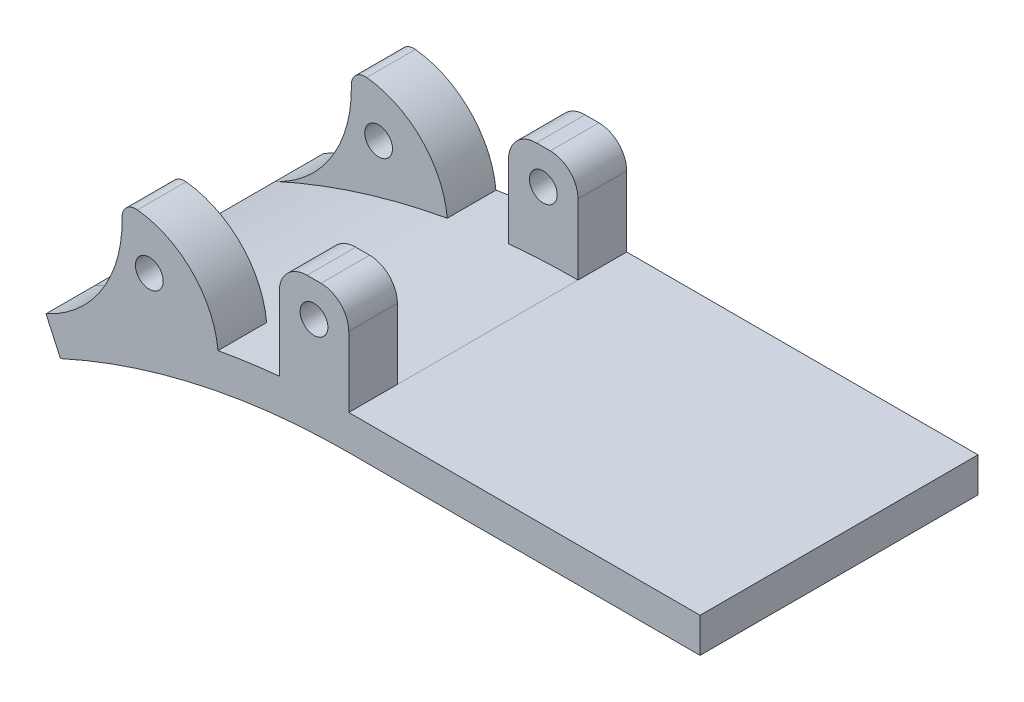
ISO-10303-21;
HEADER;
FILE_DESCRIPTION(('STEP AP214'),'2;1');
FILE_NAME('part.step','',(''),(''),'','','');
FILE_SCHEMA(('AUTOMOTIVE_DESIGN { 1 0 10303 214 1 1 1 1 }'));
ENDSEC;
DATA;
#1=APPLICATION_CONTEXT('core data for automotive mechanical design processes');
#2=APPLICATION_PROTOCOL_DEFINITION('international standard','automotive_design',2000,#1);
#3=PRODUCT_CONTEXT('',#1,'mechanical');
#4=PRODUCT('Part','Part','',(#3));
#5=PRODUCT_RELATED_PRODUCT_CATEGORY('part','',(#4));
#6=PRODUCT_DEFINITION_FORMATION('','',#4);
#7=PRODUCT_DEFINITION_CONTEXT('part definition',#1,'design');
#8=PRODUCT_DEFINITION('design','',#6,#7);
#9=PRODUCT_DEFINITION_SHAPE('','',#8);
#10=(LENGTH_UNIT() NAMED_UNIT(*) SI_UNIT(.MILLI.,.METRE.));
#11=(NAMED_UNIT(*) PLANE_ANGLE_UNIT() SI_UNIT($,.RADIAN.));
#12=(NAMED_UNIT(*) SI_UNIT($,.STERADIAN.) SOLID_ANGLE_UNIT());
#13=UNCERTAINTY_MEASURE_WITH_UNIT(LENGTH_MEASURE(1.E-05),#10,'distance_accuracy_value','');
#14=(GEOMETRIC_REPRESENTATION_CONTEXT(3) GLOBAL_UNCERTAINTY_ASSIGNED_CONTEXT((#13)) GLOBAL_UNIT_ASSIGNED_CONTEXT((#10,
#11,#12)) REPRESENTATION_CONTEXT('',''));
#15=CARTESIAN_POINT('',(0.,0.,0.));
#16=DIRECTION('',(0.,0.,1.));
#17=DIRECTION('',(1.,0.,0.));
#18=AXIS2_PLACEMENT_3D('',#15,#16,#17);
#19=CARTESIAN_POINT('',(42.6716125413464,-120.300375652099,-1.));
#20=DIRECTION('',(0.,0.,-1.));
#21=DIRECTION('',(-1.,0.,0.));
#22=AXIS2_PLACEMENT_3D('',#19,#20,#21);
#23=PLANE('',#22);
#24=CARTESIAN_POINT('',(42.6716125413464,-120.300375652099,-1.));
#25=DIRECTION('',(0.,0.,1.));
#26=DIRECTION('',(1.,0.,0.));
#27=AXIS2_PLACEMENT_3D('',#24,#25,#26);
#28=CIRCLE('',#27,99.8209717605931);
#29=CARTESIAN_POINT('',(42.671612541347,-20.4794038915055,-1.));
#30=VERTEX_POINT('',#29);
#31=CARTESIAN_POINT('',(1.1775006641315,-29.5123528586139,-1.));
#32=VERTEX_POINT('',#31);
#33=EDGE_CURVE('E388',#30,#32,#28,.T.);
#34=ORIENTED_EDGE('',*,*,#33,.T.);
#35=DIRECTION('',(0.415685312869252,-0.909508504998602,0.));
#36=VECTOR('',#35,1.);
#37=CARTESIAN_POINT('',(-0.900925900214761,-24.9648103336209,-1.));
#38=LINE('',#37,#36);
#39=CARTESIAN_POINT('',(-0.900925900214768,-24.9648103336209,-1.));
#40=VERTEX_POINT('',#39);
#41=EDGE_CURVE('E407',#40,#32,#38,.T.);
#42=ORIENTED_EDGE('',*,*,#41,.F.);
#43=CARTESIAN_POINT('',(-8.69243048840007,-7.91720371799062,-1.));
#44=DIRECTION('',(0.,0.,1.));
#45=DIRECTION('',(1.,0.,0.));
#46=AXIS2_PLACEMENT_3D('',#43,#44,#45);
#47=CIRCLE('',#46,18.7437572292482);
#48=CARTESIAN_POINT('',(10.0460894672162,-7.47414058257501,-1.));
#49=VERTEX_POINT('',#48);
#50=EDGE_CURVE('E358',#40,#49,#47,.T.);
#51=ORIENTED_EDGE('',*,*,#50,.T.);
#52=CARTESIAN_POINT('',(12.0455306386347,-7.42686477442228,-1.));
#53=DIRECTION('',(0.,0.,-1.));
#54=DIRECTION('',(-1.,0.,0.));
#55=AXIS2_PLACEMENT_3D('',#52,#53,#54);
#56=CIRCLE('',#55,2.);
#57=CARTESIAN_POINT('',(12.254952675335,-5.43785939219117,-1.));
#58=VERTEX_POINT('',#57);
#59=EDGE_CURVE('E375',#49,#58,#56,.T.);
#60=ORIENTED_EDGE('',*,*,#59,.T.);
#61=CARTESIAN_POINT('',(10.892712538025,-18.3758625158982,-1.));
#62=DIRECTION('',(0.,0.,-1.));
#63=DIRECTION('',(1.,0.,0.));
#64=AXIS2_PLACEMENT_3D('',#61,#62,#63);
#65=CIRCLE('',#64,13.0095204762033);
#66=CARTESIAN_POINT('',(23.8474768306708,-17.1835097397702,-1.));
#67=VERTEX_POINT('',#66);
#68=EDGE_CURVE('E365',#58,#67,#65,.T.);
#69=ORIENTED_EDGE('',*,*,#68,.T.);
#70=CARTESIAN_POINT('',(42.6716125413464,-120.300375652099,-1.));
#71=DIRECTION('',(0.,0.,1.));
#72=DIRECTION('',(1.,0.,0.));
#73=AXIS2_PLACEMENT_3D('',#70,#71,#72);
#74=CIRCLE('',#73,104.820971760593);
#75=CARTESIAN_POINT('',(32.671612541347,-15.957497980285,-1.));
#76=VERTEX_POINT('',#75);
#77=EDGE_CURVE('E405',#76,#67,#74,.T.);
#78=ORIENTED_EDGE('',*,*,#77,.F.);
#79=DIRECTION('',(0.,1.,0.));
#80=VECTOR('',#79,1.);
#81=CARTESIAN_POINT('',(32.671612541347,-15.957497980285,-1.));
#82=LINE('',#81,#80);
#83=CARTESIAN_POINT('',(32.671612541347,-5.37678304765752,-1.));
#84=VERTEX_POINT('',#83);
#85=EDGE_CURVE('E215',#76,#84,#82,.T.);
#86=ORIENTED_EDGE('',*,*,#85,.T.);
#87=CARTESIAN_POINT('',(36.671612541347,-5.37678304765752,-1.));
#88=DIRECTION('',(0.,0.,-1.));
#89=DIRECTION('',(-1.,0.,0.));
#90=AXIS2_PLACEMENT_3D('',#87,#88,#89);
#91=CIRCLE('',#90,4.);
#92=CARTESIAN_POINT('',(36.671612541347,-1.37678304765752,-1.));
#93=VERTEX_POINT('',#92);
#94=EDGE_CURVE('E251',#84,#93,#91,.T.);
#95=ORIENTED_EDGE('',*,*,#94,.T.);
#96=DIRECTION('',(1.,0.,0.));
#97=VECTOR('',#96,1.);
#98=CARTESIAN_POINT('',(36.671612541347,-1.37678304765752,-1.));
#99=LINE('',#98,#97);
#100=CARTESIAN_POINT('',(38.671612541347,-1.37678304765752,-1.));
#101=VERTEX_POINT('',#100);
#102=EDGE_CURVE('E255',#93,#101,#99,.T.);
#103=ORIENTED_EDGE('',*,*,#102,.T.);
#104=CARTESIAN_POINT('',(38.671612541347,-5.37678304765752,-1.));
#105=DIRECTION('',(0.,0.,-1.));
#106=DIRECTION('',(-1.,0.,0.));
#107=AXIS2_PLACEMENT_3D('',#104,#105,#106);
#108=CIRCLE('',#107,4.);
#109=CARTESIAN_POINT('',(42.671612541347,-5.37678304765755,-1.));
#110=VERTEX_POINT('',#109);
#111=EDGE_CURVE('E236',#101,#110,#108,.T.);
#112=ORIENTED_EDGE('',*,*,#111,.T.);
#113=DIRECTION('',(0.,-1.,0.));
#114=VECTOR('',#113,1.);
#115=CARTESIAN_POINT('',(42.671612541347,-5.37678304765755,-1.));
#116=LINE('',#115,#114);
#117=CARTESIAN_POINT('',(42.6716125413471,-15.4794038915055,-1.));
#118=VERTEX_POINT('',#117);
#119=EDGE_CURVE('E233',#110,#118,#116,.T.);
#120=ORIENTED_EDGE('',*,*,#119,.T.);
#121=DIRECTION('',(-1.,0.,0.));
#122=VECTOR('',#121,1.);
#123=CARTESIAN_POINT('',(42.671612541347,-15.4794038915055,-1.));
#124=LINE('',#123,#122);
#125=CARTESIAN_POINT('',(93.2317342644276,-15.4794038915057,-1.));
#126=VERTEX_POINT('',#125);
#127=EDGE_CURVE('E401',#126,#118,#124,.T.);
#128=ORIENTED_EDGE('',*,*,#127,.F.);
#129=DIRECTION('',(0.,1.,0.));
#130=VECTOR('',#129,1.);
#131=CARTESIAN_POINT('',(93.2317342644276,-15.4794038915057,-1.));
#132=LINE('',#131,#130);
#133=CARTESIAN_POINT('',(93.2317342644276,-20.4794038915057,-1.));
#134=VERTEX_POINT('',#133);
#135=EDGE_CURVE('E398',#134,#126,#132,.T.);
#136=ORIENTED_EDGE('',*,*,#135,.F.);
#137=DIRECTION('',(-1.,0.,0.));
#138=VECTOR('',#137,1.);
#139=CARTESIAN_POINT('',(93.2317342644276,-20.4794038915057,-1.));
#140=LINE('',#139,#138);
#141=EDGE_CURVE('E385',#134,#30,#140,.T.);
#142=ORIENTED_EDGE('',*,*,#141,.T.);
#143=EDGE_LOOP('',(#34,#42,#51,#60,#69,#78,#86,#95,#103,#112,#120,#128,#136,#142));
#144=FACE_BOUND('',#143,.T.);
#145=CARTESIAN_POINT('',(13.9662746895762,-12.4794038915054,-1.));
#146=DIRECTION('',(0.,0.,-1.));
#147=DIRECTION('',(-1.,0.,0.));
#148=AXIS2_PLACEMENT_3D('',#145,#146,#147);
#149=CIRCLE('',#148,2.);
#150=CARTESIAN_POINT('',(11.9662746895762,-12.4794038915054,-1.));
#151=VERTEX_POINT('',#150);
#152=EDGE_CURVE('E348',#151,#151,#149,.T.);
#153=ORIENTED_EDGE('',*,*,#152,.F.);
#154=EDGE_LOOP('',(#153));
#155=FACE_BOUND('',#154,.T.);
#156=CARTESIAN_POINT('',(37.671612541347,-6.37678304765752,-1.));
#157=DIRECTION('',(0.,0.,-1.));
#158=DIRECTION('',(-1.,0.,0.));
#159=AXIS2_PLACEMENT_3D('',#156,#157,#158);
#160=CIRCLE('',#159,2.);
#161=CARTESIAN_POINT('',(35.671612541347,-6.37678304765752,-1.));
#162=VERTEX_POINT('',#161);
#163=EDGE_CURVE('E239',#162,#162,#160,.T.);
#164=ORIENTED_EDGE('',*,*,#163,.F.);
#165=EDGE_LOOP('',(#164));
#166=FACE_BOUND('',#165,.T.);
#167=ADVANCED_FACE('F51',(#144,#155,#166),#23,.T.);
#168=CARTESIAN_POINT('',(42.6716125413464,-120.300375652099,39.));
#169=DIRECTION('',(0.,0.,1.));
#170=DIRECTION('',(-1.,0.,0.));
#171=AXIS2_PLACEMENT_3D('',#168,#169,#170);
#172=PLANE('',#171);
#173=CARTESIAN_POINT('',(42.6716125413464,-120.300375652099,39.));
#174=DIRECTION('',(0.,0.,1.));
#175=DIRECTION('',(1.,0.,0.));
#176=AXIS2_PLACEMENT_3D('',#173,#174,#175);
#177=CIRCLE('',#176,99.8209717605931);
#178=CARTESIAN_POINT('',(42.671612541347,-20.4794038915055,39.));
#179=VERTEX_POINT('',#178);
#180=CARTESIAN_POINT('',(1.1775006641315,-29.5123528586139,39.));
#181=VERTEX_POINT('',#180);
#182=EDGE_CURVE('E389',#179,#181,#177,.T.);
#183=ORIENTED_EDGE('',*,*,#182,.F.);
#184=DIRECTION('',(-1.,0.,0.));
#185=VECTOR('',#184,1.);
#186=CARTESIAN_POINT('',(93.2317342644276,-20.4794038915057,39.));
#187=LINE('',#186,#185);
#188=CARTESIAN_POINT('',(93.2317342644276,-20.4794038915057,39.));
#189=VERTEX_POINT('',#188);
#190=EDGE_CURVE('E381',#189,#179,#187,.T.);
#191=ORIENTED_EDGE('',*,*,#190,.F.);
#192=DIRECTION('',(0.,1.,0.));
#193=VECTOR('',#192,1.);
#194=CARTESIAN_POINT('',(93.2317342644276,-15.4794038915057,39.));
#195=LINE('',#194,#193);
#196=CARTESIAN_POINT('',(93.2317342644276,-15.4794038915057,39.));
#197=VERTEX_POINT('',#196);
#198=EDGE_CURVE('E397',#189,#197,#195,.T.);
#199=ORIENTED_EDGE('',*,*,#198,.T.);
#200=DIRECTION('',(-1.,0.,0.));
#201=VECTOR('',#200,1.);
#202=CARTESIAN_POINT('',(42.671612541347,-15.4794038915055,39.));
#203=LINE('',#202,#201);
#204=CARTESIAN_POINT('',(42.671612541347,-15.4794038915055,39.));
#205=VERTEX_POINT('',#204);
#206=EDGE_CURVE('E413',#197,#205,#203,.T.);
#207=ORIENTED_EDGE('',*,*,#206,.T.);
#208=DIRECTION('',(0.,1.,0.));
#209=VECTOR('',#208,1.);
#210=CARTESIAN_POINT('',(42.671612541347,-15.4794038915055,39.));
#211=LINE('',#210,#209);
#212=CARTESIAN_POINT('',(42.671612541347,-5.37678304765755,39.));
#213=VERTEX_POINT('',#212);
#214=EDGE_CURVE('E271',#205,#213,#211,.T.);
#215=ORIENTED_EDGE('',*,*,#214,.T.);
#216=CARTESIAN_POINT('',(38.671612541347,-5.37678304765752,39.));
#217=DIRECTION('',(0.,0.,1.));
#218=DIRECTION('',(1.,0.,0.));
#219=AXIS2_PLACEMENT_3D('',#216,#217,#218);
#220=CIRCLE('',#219,4.);
#221=CARTESIAN_POINT('',(38.671612541347,-1.37678304765752,39.));
#222=VERTEX_POINT('',#221);
#223=EDGE_CURVE('E295',#213,#222,#220,.T.);
#224=ORIENTED_EDGE('',*,*,#223,.T.);
#225=DIRECTION('',(-1.,0.,0.));
#226=VECTOR('',#225,1.);
#227=CARTESIAN_POINT('',(38.671612541347,-1.37678304765752,39.));
#228=LINE('',#227,#226);
#229=CARTESIAN_POINT('',(36.671612541347,-1.37678304765752,39.));
#230=VERTEX_POINT('',#229);
#231=EDGE_CURVE('E298',#222,#230,#228,.T.);
#232=ORIENTED_EDGE('',*,*,#231,.T.);
#233=CARTESIAN_POINT('',(36.671612541347,-5.37678304765752,39.));
#234=DIRECTION('',(0.,0.,1.));
#235=DIRECTION('',(1.,0.,0.));
#236=AXIS2_PLACEMENT_3D('',#233,#234,#235);
#237=CIRCLE('',#236,4.);
#238=CARTESIAN_POINT('',(32.671612541347,-5.37678304765752,39.));
#239=VERTEX_POINT('',#238);
#240=EDGE_CURVE('E301',#230,#239,#237,.T.);
#241=ORIENTED_EDGE('',*,*,#240,.T.);
#242=DIRECTION('',(0.,-1.,0.));
#243=VECTOR('',#242,1.);
#244=CARTESIAN_POINT('',(32.671612541347,-15.957497980285,39.));
#245=LINE('',#244,#243);
#246=CARTESIAN_POINT('',(32.671612541347,-15.957497980285,39.));
#247=VERTEX_POINT('',#246);
#248=EDGE_CURVE('E277',#239,#247,#245,.T.);
#249=ORIENTED_EDGE('',*,*,#248,.T.);
#250=CARTESIAN_POINT('',(42.6716125413464,-120.300375652099,39.));
#251=DIRECTION('',(0.,0.,1.));
#252=DIRECTION('',(1.,0.,0.));
#253=AXIS2_PLACEMENT_3D('',#250,#251,#252);
#254=CIRCLE('',#253,104.820971760593);
#255=CARTESIAN_POINT('',(23.8474768306708,-17.1835097397702,39.));
#256=VERTEX_POINT('',#255);
#257=EDGE_CURVE('E416',#247,#256,#254,.T.);
#258=ORIENTED_EDGE('',*,*,#257,.T.);
#259=CARTESIAN_POINT('',(10.892712538025,-18.3758625158982,39.));
#260=DIRECTION('',(0.,0.,1.));
#261=DIRECTION('',(1.,0.,0.));
#262=AXIS2_PLACEMENT_3D('',#259,#260,#261);
#263=CIRCLE('',#262,13.0095204762033);
#264=CARTESIAN_POINT('',(12.254952675335,-5.43785939219117,39.));
#265=VERTEX_POINT('',#264);
#266=EDGE_CURVE('E322',#256,#265,#263,.T.);
#267=ORIENTED_EDGE('',*,*,#266,.T.);
#268=CARTESIAN_POINT('',(12.0455306386347,-7.42686477442228,39.));
#269=DIRECTION('',(0.,0.,1.));
#270=DIRECTION('',(1.,0.,0.));
#271=AXIS2_PLACEMENT_3D('',#268,#269,#270);
#272=CIRCLE('',#271,2.);
#273=CARTESIAN_POINT('',(10.0460894672162,-7.47414058257501,39.));
#274=VERTEX_POINT('',#273);
#275=EDGE_CURVE('E341',#265,#274,#272,.T.);
#276=ORIENTED_EDGE('',*,*,#275,.T.);
#277=CARTESIAN_POINT('',(-8.69243048840007,-7.91720371799062,39.));
#278=DIRECTION('',(0.,0.,-1.));
#279=DIRECTION('',(1.,0.,0.));
#280=AXIS2_PLACEMENT_3D('',#277,#278,#279);
#281=CIRCLE('',#280,18.7437572292482);
#282=CARTESIAN_POINT('',(-0.900925900214761,-24.9648103336209,39.));
#283=VERTEX_POINT('',#282);
#284=EDGE_CURVE('E329',#274,#283,#281,.T.);
#285=ORIENTED_EDGE('',*,*,#284,.T.);
#286=DIRECTION('',(0.415685312869252,-0.909508504998602,0.));
#287=VECTOR('',#286,1.);
#288=CARTESIAN_POINT('',(-0.900925900214761,-24.9648103336209,39.));
#289=LINE('',#288,#287);
#290=EDGE_CURVE('E402',#283,#181,#289,.T.);
#291=ORIENTED_EDGE('',*,*,#290,.T.);
#292=EDGE_LOOP('',(#183,#191,#199,#207,#215,#224,#232,#241,#249,#258,#267,#276,#285,#291));
#293=FACE_BOUND('',#292,.T.);
#294=CARTESIAN_POINT('',(13.9662746895762,-12.4794038915054,39.));
#295=DIRECTION('',(0.,0.,1.));
#296=DIRECTION('',(1.,0.,0.));
#297=AXIS2_PLACEMENT_3D('',#294,#295,#296);
#298=CIRCLE('',#297,2.);
#299=CARTESIAN_POINT('',(15.9662746895762,-12.4794038915054,39.));
#300=VERTEX_POINT('',#299);
#301=EDGE_CURVE('E308',#300,#300,#298,.T.);
#302=ORIENTED_EDGE('',*,*,#301,.F.);
#303=EDGE_LOOP('',(#302));
#304=FACE_BOUND('',#303,.T.);
#305=CARTESIAN_POINT('',(37.671612541347,-6.37678304765752,39.));
#306=DIRECTION('',(0.,0.,1.));
#307=DIRECTION('',(1.,0.,0.));
#308=AXIS2_PLACEMENT_3D('',#305,#306,#307);
#309=CIRCLE('',#308,2.);
#310=CARTESIAN_POINT('',(39.671612541347,-6.37678304765752,39.));
#311=VERTEX_POINT('',#310);
#312=EDGE_CURVE('E262',#311,#311,#309,.T.);
#313=ORIENTED_EDGE('',*,*,#312,.F.);
#314=EDGE_LOOP('',(#313));
#315=FACE_BOUND('',#314,.T.);
#316=ADVANCED_FACE('F467',(#293,#304,#315),#172,.T.);
#317=CARTESIAN_POINT('',(42.671612541347,-20.4794038915055,-1.));
#318=DIRECTION('',(0.,-1.,0.));
#319=DIRECTION('',(1.,0.,0.));
#320=AXIS2_PLACEMENT_3D('',#317,#318,#319);
#321=PLANE('',#320);
#322=ORIENTED_EDGE('',*,*,#141,.F.);
#323=DIRECTION('',(0.,0.,1.));
#324=VECTOR('',#323,1.);
#325=CARTESIAN_POINT('',(93.2317342644276,-20.4794038915054,-1.));
#326=LINE('',#325,#324);
#327=EDGE_CURVE('E13',#189,#134,#326,.F.);
#328=ORIENTED_EDGE('',*,*,#327,.F.);
#329=ORIENTED_EDGE('',*,*,#190,.T.);
#330=DIRECTION('',(0.,0.,1.));
#331=VECTOR('',#330,1.);
#332=CARTESIAN_POINT('',(42.671612541347,-20.4794038915055,-1.));
#333=LINE('',#332,#331);
#334=EDGE_CURVE('E392',#30,#179,#333,.T.);
#335=ORIENTED_EDGE('',*,*,#334,.F.);
#336=EDGE_LOOP('',(#322,#328,#329,#335));
#337=FACE_BOUND('',#336,.T.);
#338=ADVANCED_FACE('F492',(#337),#321,.T.);
#339=CARTESIAN_POINT('',(-0.900925900214761,-24.9648103336209,-1.));
#340=DIRECTION('',(-0.909508504998602,-0.415685312869252,0.));
#341=DIRECTION('',(0.415685312869252,-0.909508504998602,0.));
#342=AXIS2_PLACEMENT_3D('',#339,#340,#341);
#343=PLANE('',#342);
#344=ORIENTED_EDGE('',*,*,#290,.F.);
#345=DIRECTION('',(0.,0.,1.));
#346=VECTOR('',#345,1.);
#347=CARTESIAN_POINT('',(-0.90092590021477,-24.9648103336209,32.));
#348=LINE('',#347,#346);
#349=CARTESIAN_POINT('',(-0.90092590021477,-24.9648103336209,32.));
#350=VERTEX_POINT('',#349);
#351=EDGE_CURVE('E345',#350,#283,#348,.T.);
#352=ORIENTED_EDGE('',*,*,#351,.F.);
#353=DIRECTION('',(0.,0.,1.));
#354=VECTOR('',#353,1.);
#355=CARTESIAN_POINT('',(-0.900925900214761,-24.9648103336209,-1.));
#356=LINE('',#355,#354);
#357=CARTESIAN_POINT('',(-0.900925900214761,-24.9648103336209,6.));
#358=VERTEX_POINT('',#357);
#359=EDGE_CURVE('E423',#358,#350,#356,.T.);
#360=ORIENTED_EDGE('',*,*,#359,.F.);
#361=EDGE_CURVE('E420',#40,#358,#356,.T.);
#362=ORIENTED_EDGE('',*,*,#361,.F.);
#363=ORIENTED_EDGE('',*,*,#41,.T.);
#364=DIRECTION('',(0.,0.,-1.));
#365=VECTOR('',#364,1.);
#366=CARTESIAN_POINT('',(1.1775006641315,-29.5123528586139,38.));
#367=LINE('',#366,#365);
#368=EDGE_CURVE('E58',#181,#32,#367,.T.);
#369=ORIENTED_EDGE('',*,*,#368,.F.);
#370=EDGE_LOOP('',(#344,#352,#360,#362,#363,#369));
#371=FACE_BOUND('',#370,.T.);
#372=ADVANCED_FACE('F438',(#371),#343,.T.);
#373=CARTESIAN_POINT('',(42.6716125413464,-120.300375652099,-1.));
#374=DIRECTION('',(0.,0.,1.));
#375=DIRECTION('',(1.,0.,0.));
#376=AXIS2_PLACEMENT_3D('',#373,#374,#375);
#377=CYLINDRICAL_SURFACE('',#376,104.820971760593);
#378=DIRECTION('',(0.,0.,-1.));
#379=VECTOR('',#378,1.);
#380=CARTESIAN_POINT('',(32.671612541347,-15.957497980285,6.));
#381=LINE('',#380,#379);
#382=CARTESIAN_POINT('',(32.671612541347,-15.957497980285,6.));
#383=VERTEX_POINT('',#382);
#384=EDGE_CURVE('E210',#383,#76,#381,.T.);
#385=ORIENTED_EDGE('',*,*,#384,.T.);
#386=ORIENTED_EDGE('',*,*,#77,.T.);
#387=DIRECTION('',(0.,0.,-1.));
#388=VECTOR('',#387,1.);
#389=CARTESIAN_POINT('',(23.8474768306708,-17.1835097397702,6.));
#390=LINE('',#389,#388);
#391=CARTESIAN_POINT('',(23.8474768306708,-17.1835097397702,6.));
#392=VERTEX_POINT('',#391);
#393=EDGE_CURVE('E73',#392,#67,#390,.T.);
#394=ORIENTED_EDGE('',*,*,#393,.F.);
#395=CARTESIAN_POINT('',(42.6716125413464,-120.300375652099,6.));
#396=DIRECTION('',(0.,0.,1.));
#397=DIRECTION('',(-1.,0.,0.));
#398=AXIS2_PLACEMENT_3D('',#395,#396,#397);
#399=CIRCLE('',#398,104.820971760593);
#400=EDGE_CURVE('E370',#392,#358,#399,.T.);
#401=ORIENTED_EDGE('',*,*,#400,.T.);
#402=ORIENTED_EDGE('',*,*,#359,.T.);
#403=CARTESIAN_POINT('',(42.6716125413464,-120.300375652099,32.));
#404=DIRECTION('',(0.,0.,-1.));
#405=DIRECTION('',(1.,0.,0.));
#406=AXIS2_PLACEMENT_3D('',#403,#404,#405);
#407=CIRCLE('',#406,104.820971760593);
#408=CARTESIAN_POINT('',(23.8474768306708,-17.1835097397702,32.));
#409=VERTEX_POINT('',#408);
#410=EDGE_CURVE('E325',#350,#409,#407,.T.);
#411=ORIENTED_EDGE('',*,*,#410,.T.);
#412=DIRECTION('',(0.,0.,1.));
#413=VECTOR('',#412,1.);
#414=CARTESIAN_POINT('',(23.8474768306708,-17.1835097397702,32.));
#415=LINE('',#414,#413);
#416=EDGE_CURVE('E338',#409,#256,#415,.T.);
#417=ORIENTED_EDGE('',*,*,#416,.T.);
#418=ORIENTED_EDGE('',*,*,#257,.F.);
#419=DIRECTION('',(0.,0.,1.));
#420=VECTOR('',#419,1.);
#421=CARTESIAN_POINT('',(32.671612541347,-15.957497980285,32.));
#422=LINE('',#421,#420);
#423=CARTESIAN_POINT('',(32.671612541347,-15.957497980285,32.));
#424=VERTEX_POINT('',#423);
#425=EDGE_CURVE('E306',#424,#247,#422,.T.);
#426=ORIENTED_EDGE('',*,*,#425,.F.);
#427=CARTESIAN_POINT('',(42.6716125413464,-120.300375652099,32.));
#428=DIRECTION('',(0.,0.,-1.));
#429=DIRECTION('',(1.,0.,0.));
#430=AXIS2_PLACEMENT_3D('',#427,#428,#429);
#431=CIRCLE('',#430,104.820971760593);
#432=CARTESIAN_POINT('',(42.671612541347,-15.4794038915055,32.));
#433=VERTEX_POINT('',#432);
#434=EDGE_CURVE('E274',#424,#433,#431,.T.);
#435=ORIENTED_EDGE('',*,*,#434,.T.);
#436=DIRECTION('',(0.,0.,1.));
#437=VECTOR('',#436,1.);
#438=CARTESIAN_POINT('',(42.671612541347,-15.4794038915055,-1.));
#439=LINE('',#438,#437);
#440=CARTESIAN_POINT('',(42.671612541347,-15.4794038915055,6.));
#441=VERTEX_POINT('',#440);
#442=EDGE_CURVE('E231',#441,#433,#439,.T.);
#443=ORIENTED_EDGE('',*,*,#442,.F.);
#444=CARTESIAN_POINT('',(42.6716125413464,-120.300375652099,6.));
#445=DIRECTION('',(0.,0.,1.));
#446=DIRECTION('',(-1.,0.,0.));
#447=AXIS2_PLACEMENT_3D('',#444,#445,#446);
#448=CIRCLE('',#447,104.820971760593);
#449=EDGE_CURVE('E223',#441,#383,#448,.T.);
#450=ORIENTED_EDGE('',*,*,#449,.T.);
#451=EDGE_LOOP('',(#385,#386,#394,#401,#402,#411,#417,#418,#426,#435,#443,#450));
#452=FACE_BOUND('',#451,.T.);
#453=ADVANCED_FACE('F229',(#452),#377,.T.);
#454=CARTESIAN_POINT('',(42.671612541347,-15.4794038915055,-1.));
#455=DIRECTION('',(0.,1.,0.));
#456=DIRECTION('',(-1.,0.,0.));
#457=AXIS2_PLACEMENT_3D('',#454,#455,#456);
#458=PLANE('',#457);
#459=ORIENTED_EDGE('',*,*,#206,.F.);
#460=DIRECTION('',(0.,0.,1.));
#461=VECTOR('',#460,1.);
#462=CARTESIAN_POINT('',(93.2317342644276,-15.4794038915057,-1.));
#463=LINE('',#462,#461);
#464=EDGE_CURVE('E410',#126,#197,#463,.T.);
#465=ORIENTED_EDGE('',*,*,#464,.F.);
#466=ORIENTED_EDGE('',*,*,#127,.T.);
#467=EDGE_CURVE('E424',#118,#441,#439,.T.);
#468=ORIENTED_EDGE('',*,*,#467,.T.);
#469=ORIENTED_EDGE('',*,*,#442,.T.);
#470=DIRECTION('',(0.,0.,1.));
#471=VECTOR('',#470,1.);
#472=CARTESIAN_POINT('',(42.671612541347,-15.4794038915055,32.));
#473=LINE('',#472,#471);
#474=EDGE_CURVE('E292',#433,#205,#473,.T.);
#475=ORIENTED_EDGE('',*,*,#474,.T.);
#476=EDGE_LOOP('',(#459,#465,#466,#468,#469,#475));
#477=FACE_BOUND('',#476,.T.);
#478=ADVANCED_FACE('F503',(#477),#458,.T.);
#479=CARTESIAN_POINT('',(93.2317342644276,-15.4794038915057,-1.));
#480=DIRECTION('',(1.,0.,0.));
#481=DIRECTION('',(0.,1.,0.));
#482=AXIS2_PLACEMENT_3D('',#479,#480,#481);
#483=PLANE('',#482);
#484=ORIENTED_EDGE('',*,*,#198,.F.);
#485=ORIENTED_EDGE('',*,*,#327,.T.);
#486=ORIENTED_EDGE('',*,*,#135,.T.);
#487=ORIENTED_EDGE('',*,*,#464,.T.);
#488=EDGE_LOOP('',(#484,#485,#486,#487));
#489=FACE_BOUND('',#488,.T.);
#490=ADVANCED_FACE('F500',(#489),#483,.T.);
#491=CARTESIAN_POINT('',(42.6716125413464,-120.300375652099,-1.));
#492=DIRECTION('',(0.,0.,1.));
#493=DIRECTION('',(1.,0.,0.));
#494=AXIS2_PLACEMENT_3D('',#491,#492,#493);
#495=CYLINDRICAL_SURFACE('',#494,99.8209717605931);
#496=ORIENTED_EDGE('',*,*,#182,.T.);
#497=ORIENTED_EDGE('',*,*,#368,.T.);
#498=ORIENTED_EDGE('',*,*,#33,.F.);
#499=ORIENTED_EDGE('',*,*,#334,.T.);
#500=EDGE_LOOP('',(#496,#497,#498,#499));
#501=FACE_BOUND('',#500,.T.);
#502=ADVANCED_FACE('F429',(#501),#495,.F.);
#503=CARTESIAN_POINT('',(-8.69243048840007,-7.91720371799062,6.));
#504=DIRECTION('',(0.,0.,-1.));
#505=DIRECTION('',(-1.,0.,0.));
#506=AXIS2_PLACEMENT_3D('',#503,#504,#505);
#507=CYLINDRICAL_SURFACE('',#506,18.7437572292482);
#508=ORIENTED_EDGE('',*,*,#50,.F.);
#509=ORIENTED_EDGE('',*,*,#361,.T.);
#510=CARTESIAN_POINT('',(-8.69243048840007,-7.91720371799062,6.));
#511=DIRECTION('',(0.,0.,1.));
#512=DIRECTION('',(1.,0.,0.));
#513=AXIS2_PLACEMENT_3D('',#510,#511,#512);
#514=CIRCLE('',#513,18.7437572292482);
#515=CARTESIAN_POINT('',(10.0460894672162,-7.47414058257501,6.));
#516=VERTEX_POINT('',#515);
#517=EDGE_CURVE('E361',#358,#516,#514,.T.);
#518=ORIENTED_EDGE('',*,*,#517,.T.);
#519=DIRECTION('',(0.,0.,-1.));
#520=VECTOR('',#519,1.);
#521=CARTESIAN_POINT('',(10.0460894672162,-7.47414058257501,6.));
#522=LINE('',#521,#520);
#523=EDGE_CURVE('E372',#516,#49,#522,.T.);
#524=ORIENTED_EDGE('',*,*,#523,.T.);
#525=EDGE_LOOP('',(#508,#509,#518,#524));
#526=FACE_BOUND('',#525,.T.);
#527=ADVANCED_FACE('F445',(#526),#507,.F.);
#528=CARTESIAN_POINT('',(10.892712538025,-18.3758625158982,6.));
#529=DIRECTION('',(0.,0.,-1.));
#530=DIRECTION('',(-1.,0.,0.));
#531=AXIS2_PLACEMENT_3D('',#528,#529,#530);
#532=CYLINDRICAL_SURFACE('',#531,13.0095204762033);
#533=ORIENTED_EDGE('',*,*,#68,.F.);
#534=DIRECTION('',(0.,0.,-1.));
#535=VECTOR('',#534,1.);
#536=CARTESIAN_POINT('',(12.254952675335,-5.43785939219117,6.));
#537=LINE('',#536,#535);
#538=CARTESIAN_POINT('',(12.254952675335,-5.43785939219117,6.));
#539=VERTEX_POINT('',#538);
#540=EDGE_CURVE('E382',#539,#58,#537,.T.);
#541=ORIENTED_EDGE('',*,*,#540,.F.);
#542=CARTESIAN_POINT('',(10.892712538025,-18.3758625158982,6.));
#543=DIRECTION('',(0.,0.,-1.));
#544=DIRECTION('',(1.,0.,0.));
#545=AXIS2_PLACEMENT_3D('',#542,#543,#544);
#546=CIRCLE('',#545,13.0095204762033);
#547=EDGE_CURVE('E368',#539,#392,#546,.T.);
#548=ORIENTED_EDGE('',*,*,#547,.T.);
#549=ORIENTED_EDGE('',*,*,#393,.T.);
#550=EDGE_LOOP('',(#533,#541,#548,#549));
#551=FACE_BOUND('',#550,.T.);
#552=ADVANCED_FACE('F453',(#551),#532,.T.);
#553=CARTESIAN_POINT('',(12.0455306386347,-7.42686477442228,6.));
#554=DIRECTION('',(0.,0.,-1.));
#555=DIRECTION('',(-1.,0.,0.));
#556=AXIS2_PLACEMENT_3D('',#553,#554,#555);
#557=CYLINDRICAL_SURFACE('',#556,2.);
#558=ORIENTED_EDGE('',*,*,#59,.F.);
#559=ORIENTED_EDGE('',*,*,#523,.F.);
#560=CARTESIAN_POINT('',(12.0455306386347,-7.42686477442228,6.));
#561=DIRECTION('',(0.,0.,-1.));
#562=DIRECTION('',(-1.,0.,0.));
#563=AXIS2_PLACEMENT_3D('',#560,#561,#562);
#564=CIRCLE('',#563,2.);
#565=EDGE_CURVE('E364',#516,#539,#564,.T.);
#566=ORIENTED_EDGE('',*,*,#565,.T.);
#567=ORIENTED_EDGE('',*,*,#540,.T.);
#568=EDGE_LOOP('',(#558,#559,#566,#567));
#569=FACE_BOUND('',#568,.T.);
#570=ADVANCED_FACE('F449',(#569),#557,.T.);
#571=CARTESIAN_POINT('',(1.67655007511733,-7.67203424620645,6.));
#572=DIRECTION('',(0.,0.,1.));
#573=DIRECTION('',(1.,0.,0.));
#574=AXIS2_PLACEMENT_3D('',#571,#572,#573);
#575=PLANE('',#574);
#576=CARTESIAN_POINT('',(13.9662746895762,-12.4794038915054,6.));
#577=DIRECTION('',(0.,0.,-1.));
#578=DIRECTION('',(-1.,0.,0.));
#579=AXIS2_PLACEMENT_3D('',#576,#577,#578);
#580=CIRCLE('',#579,2.);
#581=CARTESIAN_POINT('',(11.9662746895762,-12.4794038915054,6.));
#582=VERTEX_POINT('',#581);
#583=EDGE_CURVE('E355',#582,#582,#580,.T.);
#584=ORIENTED_EDGE('',*,*,#583,.T.);
#585=EDGE_LOOP('',(#584));
#586=FACE_BOUND('',#585,.T.);
#587=ORIENTED_EDGE('',*,*,#517,.F.);
#588=ORIENTED_EDGE('',*,*,#400,.F.);
#589=ORIENTED_EDGE('',*,*,#547,.F.);
#590=ORIENTED_EDGE('',*,*,#565,.F.);
#591=EDGE_LOOP('',(#587,#588,#589,#590));
#592=FACE_BOUND('',#591,.T.);
#593=ADVANCED_FACE('F456',(#586,#592),#575,.T.);
#594=CARTESIAN_POINT('',(13.9662746895762,-12.4794038915054,6.));
#595=DIRECTION('',(0.,0.,-1.));
#596=DIRECTION('',(-1.,0.,0.));
#597=AXIS2_PLACEMENT_3D('',#594,#595,#596);
#598=CYLINDRICAL_SURFACE('',#597,2.);
#599=ORIENTED_EDGE('',*,*,#583,.F.);
#600=EDGE_LOOP('',(#599));
#601=FACE_BOUND('',#600,.T.);
#602=ORIENTED_EDGE('',*,*,#152,.T.);
#603=EDGE_LOOP('',(#602));
#604=FACE_BOUND('',#603,.T.);
#605=ADVANCED_FACE('F521',(#601,#604),#598,.F.);
#606=CARTESIAN_POINT('',(-8.69243048840007,-7.91720371799062,32.));
#607=DIRECTION('',(0.,0.,1.));
#608=DIRECTION('',(1.,0.,0.));
#609=AXIS2_PLACEMENT_3D('',#606,#607,#608);
#610=CYLINDRICAL_SURFACE('',#609,18.7437572292482);
#611=ORIENTED_EDGE('',*,*,#284,.F.);
#612=DIRECTION('',(0.,0.,1.));
#613=VECTOR('',#612,1.);
#614=CARTESIAN_POINT('',(10.0460894672162,-7.47414058257501,32.));
#615=LINE('',#614,#613);
#616=CARTESIAN_POINT('',(10.0460894672162,-7.47414058257501,32.));
#617=VERTEX_POINT('',#616);
#618=EDGE_CURVE('E349',#617,#274,#615,.T.);
#619=ORIENTED_EDGE('',*,*,#618,.F.);
#620=CARTESIAN_POINT('',(-8.69243048840007,-7.91720371799062,32.));
#621=DIRECTION('',(0.,0.,-1.));
#622=DIRECTION('',(1.,0.,0.));
#623=AXIS2_PLACEMENT_3D('',#620,#621,#622);
#624=CIRCLE('',#623,18.7437572292482);
#625=EDGE_CURVE('E335',#617,#350,#624,.T.);
#626=ORIENTED_EDGE('',*,*,#625,.T.);
#627=ORIENTED_EDGE('',*,*,#351,.T.);
#628=EDGE_LOOP('',(#611,#619,#626,#627));
#629=FACE_BOUND('',#628,.T.);
#630=ADVANCED_FACE('F465',(#629),#610,.F.);
#631=CARTESIAN_POINT('',(12.0455306386347,-7.42686477442228,32.));
#632=DIRECTION('',(0.,0.,1.));
#633=DIRECTION('',(1.,0.,0.));
#634=AXIS2_PLACEMENT_3D('',#631,#632,#633);
#635=CYLINDRICAL_SURFACE('',#634,2.);
#636=ORIENTED_EDGE('',*,*,#275,.F.);
#637=DIRECTION('',(0.,0.,1.));
#638=VECTOR('',#637,1.);
#639=CARTESIAN_POINT('',(12.254952675335,-5.43785939219117,32.));
#640=LINE('',#639,#638);
#641=CARTESIAN_POINT('',(12.254952675335,-5.43785939219117,32.));
#642=VERTEX_POINT('',#641);
#643=EDGE_CURVE('E351',#642,#265,#640,.T.);
#644=ORIENTED_EDGE('',*,*,#643,.F.);
#645=CARTESIAN_POINT('',(12.0455306386347,-7.42686477442228,32.));
#646=DIRECTION('',(0.,0.,1.));
#647=DIRECTION('',(1.,0.,0.));
#648=AXIS2_PLACEMENT_3D('',#645,#646,#647);
#649=CIRCLE('',#648,2.);
#650=EDGE_CURVE('E332',#642,#617,#649,.T.);
#651=ORIENTED_EDGE('',*,*,#650,.T.);
#652=ORIENTED_EDGE('',*,*,#618,.T.);
#653=EDGE_LOOP('',(#636,#644,#651,#652));
#654=FACE_BOUND('',#653,.T.);
#655=ADVANCED_FACE('F473',(#654),#635,.T.);
#656=CARTESIAN_POINT('',(10.892712538025,-18.3758625158982,32.));
#657=DIRECTION('',(0.,0.,1.));
#658=DIRECTION('',(1.,0.,0.));
#659=AXIS2_PLACEMENT_3D('',#656,#657,#658);
#660=CYLINDRICAL_SURFACE('',#659,13.0095204762033);
#661=ORIENTED_EDGE('',*,*,#266,.F.);
#662=ORIENTED_EDGE('',*,*,#416,.F.);
#663=CARTESIAN_POINT('',(10.892712538025,-18.3758625158982,32.));
#664=DIRECTION('',(0.,0.,1.));
#665=DIRECTION('',(1.,0.,0.));
#666=AXIS2_PLACEMENT_3D('',#663,#664,#665);
#667=CIRCLE('',#666,13.0095204762033);
#668=EDGE_CURVE('E328',#409,#642,#667,.T.);
#669=ORIENTED_EDGE('',*,*,#668,.T.);
#670=ORIENTED_EDGE('',*,*,#643,.T.);
#671=EDGE_LOOP('',(#661,#662,#669,#670));
#672=FACE_BOUND('',#671,.T.);
#673=ADVANCED_FACE('F475',(#672),#660,.T.);
#674=CARTESIAN_POINT('',(16.9895910264732,-64.1087896850446,32.));
#675=DIRECTION('',(0.,0.,1.));
#676=DIRECTION('',(1.,0.,0.));
#677=AXIS2_PLACEMENT_3D('',#674,#675,#676);
#678=PLANE('',#677);
#679=CARTESIAN_POINT('',(13.9662746895762,-12.4794038915054,32.));
#680=DIRECTION('',(0.,0.,1.));
#681=DIRECTION('',(1.,0.,0.));
#682=AXIS2_PLACEMENT_3D('',#679,#680,#681);
#683=CIRCLE('',#682,2.);
#684=CARTESIAN_POINT('',(15.9662746895762,-12.4794038915054,32.));
#685=VERTEX_POINT('',#684);
#686=EDGE_CURVE('E319',#685,#685,#683,.T.);
#687=ORIENTED_EDGE('',*,*,#686,.T.);
#688=EDGE_LOOP('',(#687));
#689=FACE_BOUND('',#688,.T.);
#690=ORIENTED_EDGE('',*,*,#410,.F.);
#691=ORIENTED_EDGE('',*,*,#625,.F.);
#692=ORIENTED_EDGE('',*,*,#650,.F.);
#693=ORIENTED_EDGE('',*,*,#668,.F.);
#694=EDGE_LOOP('',(#690,#691,#692,#693));
#695=FACE_BOUND('',#694,.T.);
#696=ADVANCED_FACE('F461',(#689,#695),#678,.F.);
#697=CARTESIAN_POINT('',(13.9662746895762,-12.4794038915054,32.));
#698=DIRECTION('',(0.,0.,1.));
#699=DIRECTION('',(1.,0.,0.));
#700=AXIS2_PLACEMENT_3D('',#697,#698,#699);
#701=CYLINDRICAL_SURFACE('',#700,2.);
#702=ORIENTED_EDGE('',*,*,#686,.F.);
#703=EDGE_LOOP('',(#702));
#704=FACE_BOUND('',#703,.T.);
#705=ORIENTED_EDGE('',*,*,#301,.T.);
#706=EDGE_LOOP('',(#705));
#707=FACE_BOUND('',#706,.T.);
#708=ADVANCED_FACE('F482',(#704,#707),#701,.F.);
#709=CARTESIAN_POINT('',(32.671612541347,-15.957497980285,32.));
#710=DIRECTION('',(-1.,0.,0.));
#711=DIRECTION('',(0.,-1.,0.));
#712=AXIS2_PLACEMENT_3D('',#709,#710,#711);
#713=PLANE('',#712);
#714=ORIENTED_EDGE('',*,*,#248,.F.);
#715=DIRECTION('',(0.,0.,1.));
#716=VECTOR('',#715,1.);
#717=CARTESIAN_POINT('',(32.671612541347,-5.37678304765752,32.));
#718=LINE('',#717,#716);
#719=CARTESIAN_POINT('',(32.671612541347,-5.37678304765752,32.));
#720=VERTEX_POINT('',#719);
#721=EDGE_CURVE('E309',#720,#239,#718,.T.);
#722=ORIENTED_EDGE('',*,*,#721,.F.);
#723=DIRECTION('',(0.,-1.,0.));
#724=VECTOR('',#723,1.);
#725=CARTESIAN_POINT('',(32.671612541347,-15.957497980285,32.));
#726=LINE('',#725,#724);
#727=EDGE_CURVE('E289',#720,#424,#726,.T.);
#728=ORIENTED_EDGE('',*,*,#727,.T.);
#729=ORIENTED_EDGE('',*,*,#425,.T.);
#730=EDGE_LOOP('',(#714,#722,#728,#729));
#731=FACE_BOUND('',#730,.T.);
#732=ADVANCED_FACE('F574',(#731),#713,.T.);
#733=CARTESIAN_POINT('',(36.671612541347,-5.37678304765752,32.));
#734=DIRECTION('',(0.,0.,1.));
#735=DIRECTION('',(1.,0.,0.));
#736=AXIS2_PLACEMENT_3D('',#733,#734,#735);
#737=CYLINDRICAL_SURFACE('',#736,4.);
#738=ORIENTED_EDGE('',*,*,#240,.F.);
#739=DIRECTION('',(0.,0.,1.));
#740=VECTOR('',#739,1.);
#741=CARTESIAN_POINT('',(36.671612541347,-1.37678304765752,32.));
#742=LINE('',#741,#740);
#743=CARTESIAN_POINT('',(36.671612541347,-1.37678304765752,32.));
#744=VERTEX_POINT('',#743);
#745=EDGE_CURVE('E311',#744,#230,#742,.T.);
#746=ORIENTED_EDGE('',*,*,#745,.F.);
#747=CARTESIAN_POINT('',(36.671612541347,-5.37678304765752,32.));
#748=DIRECTION('',(0.,0.,1.));
#749=DIRECTION('',(1.,0.,0.));
#750=AXIS2_PLACEMENT_3D('',#747,#748,#749);
#751=CIRCLE('',#750,4.);
#752=EDGE_CURVE('E286',#744,#720,#751,.T.);
#753=ORIENTED_EDGE('',*,*,#752,.T.);
#754=ORIENTED_EDGE('',*,*,#721,.T.);
#755=EDGE_LOOP('',(#738,#746,#753,#754));
#756=FACE_BOUND('',#755,.T.);
#757=ADVANCED_FACE('F576',(#756),#737,.T.);
#758=CARTESIAN_POINT('',(38.671612541347,-1.37678304765752,32.));
#759=DIRECTION('',(0.,1.,0.));
#760=DIRECTION('',(-1.,0.,0.));
#761=AXIS2_PLACEMENT_3D('',#758,#759,#760);
#762=PLANE('',#761);
#763=ORIENTED_EDGE('',*,*,#231,.F.);
#764=DIRECTION('',(0.,0.,1.));
#765=VECTOR('',#764,1.);
#766=CARTESIAN_POINT('',(38.671612541347,-1.37678304765752,32.));
#767=LINE('',#766,#765);
#768=CARTESIAN_POINT('',(38.671612541347,-1.37678304765752,32.));
#769=VERTEX_POINT('',#768);
#770=EDGE_CURVE('E313',#769,#222,#767,.T.);
#771=ORIENTED_EDGE('',*,*,#770,.F.);
#772=DIRECTION('',(-1.,0.,0.));
#773=VECTOR('',#772,1.);
#774=CARTESIAN_POINT('',(38.671612541347,-1.37678304765752,32.));
#775=LINE('',#774,#773);
#776=EDGE_CURVE('E283',#769,#744,#775,.T.);
#777=ORIENTED_EDGE('',*,*,#776,.T.);
#778=ORIENTED_EDGE('',*,*,#745,.T.);
#779=EDGE_LOOP('',(#763,#771,#777,#778));
#780=FACE_BOUND('',#779,.T.);
#781=ADVANCED_FACE('F580',(#780),#762,.T.);
#782=CARTESIAN_POINT('',(38.671612541347,-5.37678304765752,32.));
#783=DIRECTION('',(0.,0.,1.));
#784=DIRECTION('',(1.,0.,0.));
#785=AXIS2_PLACEMENT_3D('',#782,#783,#784);
#786=CYLINDRICAL_SURFACE('',#785,4.);
#787=ORIENTED_EDGE('',*,*,#223,.F.);
#788=DIRECTION('',(0.,0.,1.));
#789=VECTOR('',#788,1.);
#790=CARTESIAN_POINT('',(42.671612541347,-5.37678304765755,32.));
#791=LINE('',#790,#789);
#792=CARTESIAN_POINT('',(42.671612541347,-5.37678304765755,32.));
#793=VERTEX_POINT('',#792);
#794=EDGE_CURVE('E315',#793,#213,#791,.T.);
#795=ORIENTED_EDGE('',*,*,#794,.F.);
#796=CARTESIAN_POINT('',(38.671612541347,-5.37678304765752,32.));
#797=DIRECTION('',(0.,0.,1.));
#798=DIRECTION('',(1.,0.,0.));
#799=AXIS2_PLACEMENT_3D('',#796,#797,#798);
#800=CIRCLE('',#799,4.);
#801=EDGE_CURVE('E280',#793,#769,#800,.T.);
#802=ORIENTED_EDGE('',*,*,#801,.T.);
#803=ORIENTED_EDGE('',*,*,#770,.T.);
#804=EDGE_LOOP('',(#787,#795,#802,#803));
#805=FACE_BOUND('',#804,.T.);
#806=ADVANCED_FACE('F584',(#805),#786,.T.);
#807=CARTESIAN_POINT('',(42.671612541347,-15.4794038915055,32.));
#808=DIRECTION('',(1.,0.,0.));
#809=DIRECTION('',(0.,0.,-1.));
#810=AXIS2_PLACEMENT_3D('',#807,#808,#809);
#811=PLANE('',#810);
#812=ORIENTED_EDGE('',*,*,#214,.F.);
#813=ORIENTED_EDGE('',*,*,#474,.F.);
#814=DIRECTION('',(0.,1.,0.));
#815=VECTOR('',#814,1.);
#816=CARTESIAN_POINT('',(42.671612541347,-15.4794038915055,32.));
#817=LINE('',#816,#815);
#818=EDGE_CURVE('E276',#433,#793,#817,.T.);
#819=ORIENTED_EDGE('',*,*,#818,.T.);
#820=ORIENTED_EDGE('',*,*,#794,.T.);
#821=EDGE_LOOP('',(#812,#813,#819,#820));
#822=FACE_BOUND('',#821,.T.);
#823=ADVANCED_FACE('F572',(#822),#811,.T.);
#824=CARTESIAN_POINT('',(42.6716125413464,-120.300375652099,32.));
#825=DIRECTION('',(0.,0.,1.));
#826=DIRECTION('',(1.,0.,0.));
#827=AXIS2_PLACEMENT_3D('',#824,#825,#826);
#828=PLANE('',#827);
#829=CARTESIAN_POINT('',(37.671612541347,-6.37678304765752,32.));
#830=DIRECTION('',(0.,0.,1.));
#831=DIRECTION('',(1.,0.,0.));
#832=AXIS2_PLACEMENT_3D('',#829,#830,#831);
#833=CIRCLE('',#832,2.);
#834=CARTESIAN_POINT('',(39.671612541347,-6.37678304765752,32.));
#835=VERTEX_POINT('',#834);
#836=EDGE_CURVE('E268',#835,#835,#833,.T.);
#837=ORIENTED_EDGE('',*,*,#836,.T.);
#838=EDGE_LOOP('',(#837));
#839=FACE_BOUND('',#838,.T.);
#840=ORIENTED_EDGE('',*,*,#434,.F.);
#841=ORIENTED_EDGE('',*,*,#727,.F.);
#842=ORIENTED_EDGE('',*,*,#752,.F.);
#843=ORIENTED_EDGE('',*,*,#776,.F.);
#844=ORIENTED_EDGE('',*,*,#801,.F.);
#845=ORIENTED_EDGE('',*,*,#818,.F.);
#846=EDGE_LOOP('',(#840,#841,#842,#843,#844,#845));
#847=FACE_BOUND('',#846,.T.);
#848=ADVANCED_FACE('F568',(#839,#847),#828,.F.);
#849=CARTESIAN_POINT('',(37.671612541347,-6.37678304765752,32.));
#850=DIRECTION('',(0.,0.,1.));
#851=DIRECTION('',(1.,0.,0.));
#852=AXIS2_PLACEMENT_3D('',#849,#850,#851);
#853=CYLINDRICAL_SURFACE('',#852,2.);
#854=ORIENTED_EDGE('',*,*,#836,.F.);
#855=EDGE_LOOP('',(#854));
#856=FACE_BOUND('',#855,.T.);
#857=ORIENTED_EDGE('',*,*,#312,.T.);
#858=EDGE_LOOP('',(#857));
#859=FACE_BOUND('',#858,.T.);
#860=ADVANCED_FACE('F552',(#856,#859),#853,.F.);
#861=CARTESIAN_POINT('',(42.671612541347,-5.37678304765755,6.));
#862=DIRECTION('',(1.,0.,0.));
#863=DIRECTION('',(0.,1.,0.));
#864=AXIS2_PLACEMENT_3D('',#861,#862,#863);
#865=PLANE('',#864);
#866=ORIENTED_EDGE('',*,*,#119,.F.);
#867=DIRECTION('',(0.,0.,-1.));
#868=VECTOR('',#867,1.);
#869=CARTESIAN_POINT('',(42.671612541347,-5.37678304765755,6.));
#870=LINE('',#869,#868);
#871=CARTESIAN_POINT('',(42.671612541347,-5.37678304765755,6.));
#872=VERTEX_POINT('',#871);
#873=EDGE_CURVE('E260',#872,#110,#870,.T.);
#874=ORIENTED_EDGE('',*,*,#873,.F.);
#875=DIRECTION('',(0.,-1.,0.));
#876=VECTOR('',#875,1.);
#877=CARTESIAN_POINT('',(42.671612541347,-5.37678304765755,6.));
#878=LINE('',#877,#876);
#879=EDGE_CURVE('E65',#872,#441,#878,.T.);
#880=ORIENTED_EDGE('',*,*,#879,.T.);
#881=ORIENTED_EDGE('',*,*,#467,.F.);
#882=EDGE_LOOP('',(#866,#874,#880,#881));
#883=FACE_BOUND('',#882,.T.);
#884=ADVANCED_FACE('F548',(#883),#865,.T.);
#885=CARTESIAN_POINT('',(38.671612541347,-5.37678304765752,6.));
#886=DIRECTION('',(0.,0.,-1.));
#887=DIRECTION('',(-1.,0.,0.));
#888=AXIS2_PLACEMENT_3D('',#885,#886,#887);
#889=CYLINDRICAL_SURFACE('',#888,4.);
#890=ORIENTED_EDGE('',*,*,#111,.F.);
#891=DIRECTION('',(0.,0.,-1.));
#892=VECTOR('',#891,1.);
#893=CARTESIAN_POINT('',(38.671612541347,-1.37678304765752,6.));
#894=LINE('',#893,#892);
#895=CARTESIAN_POINT('',(38.671612541347,-1.37678304765752,6.));
#896=VERTEX_POINT('',#895);
#897=EDGE_CURVE('E263',#896,#101,#894,.T.);
#898=ORIENTED_EDGE('',*,*,#897,.F.);
#899=CARTESIAN_POINT('',(38.671612541347,-5.37678304765752,6.));
#900=DIRECTION('',(0.,0.,-1.));
#901=DIRECTION('',(-1.,0.,0.));
#902=AXIS2_PLACEMENT_3D('',#899,#900,#901);
#903=CIRCLE('',#902,4.);
#904=EDGE_CURVE('E246',#896,#872,#903,.T.);
#905=ORIENTED_EDGE('',*,*,#904,.T.);
#906=ORIENTED_EDGE('',*,*,#873,.T.);
#907=EDGE_LOOP('',(#890,#898,#905,#906));
#908=FACE_BOUND('',#907,.T.);
#909=ADVANCED_FACE('F551',(#908),#889,.T.);
#910=CARTESIAN_POINT('',(36.671612541347,-1.37678304765752,6.));
#911=DIRECTION('',(0.,1.,0.));
#912=DIRECTION('',(-1.,0.,0.));
#913=AXIS2_PLACEMENT_3D('',#910,#911,#912);
#914=PLANE('',#913);
#915=ORIENTED_EDGE('',*,*,#102,.F.);
#916=DIRECTION('',(0.,0.,-1.));
#917=VECTOR('',#916,1.);
#918=CARTESIAN_POINT('',(36.671612541347,-1.37678304765752,6.));
#919=LINE('',#918,#917);
#920=CARTESIAN_POINT('',(36.671612541347,-1.37678304765752,6.));
#921=VERTEX_POINT('',#920);
#922=EDGE_CURVE('E265',#921,#93,#919,.T.);
#923=ORIENTED_EDGE('',*,*,#922,.F.);
#924=DIRECTION('',(1.,0.,0.));
#925=VECTOR('',#924,1.);
#926=CARTESIAN_POINT('',(36.671612541347,-1.37678304765752,6.));
#927=LINE('',#926,#925);
#928=EDGE_CURVE('E243',#921,#896,#927,.T.);
#929=ORIENTED_EDGE('',*,*,#928,.T.);
#930=ORIENTED_EDGE('',*,*,#897,.T.);
#931=EDGE_LOOP('',(#915,#923,#929,#930));
#932=FACE_BOUND('',#931,.T.);
#933=ADVANCED_FACE('F555',(#932),#914,.T.);
#934=CARTESIAN_POINT('',(36.671612541347,-5.37678304765752,6.));
#935=DIRECTION('',(0.,0.,-1.));
#936=DIRECTION('',(-1.,0.,0.));
#937=AXIS2_PLACEMENT_3D('',#934,#935,#936);
#938=CYLINDRICAL_SURFACE('',#937,4.);
#939=ORIENTED_EDGE('',*,*,#94,.F.);
#940=DIRECTION('',(0.,0.,-1.));
#941=VECTOR('',#940,1.);
#942=CARTESIAN_POINT('',(32.671612541347,-5.37678304765752,6.));
#943=LINE('',#942,#941);
#944=CARTESIAN_POINT('',(32.671612541347,-5.37678304765752,6.));
#945=VERTEX_POINT('',#944);
#946=EDGE_CURVE('E218',#945,#84,#943,.T.);
#947=ORIENTED_EDGE('',*,*,#946,.F.);
#948=CARTESIAN_POINT('',(36.671612541347,-5.37678304765752,6.));
#949=DIRECTION('',(0.,0.,-1.));
#950=DIRECTION('',(-1.,0.,0.));
#951=AXIS2_PLACEMENT_3D('',#948,#949,#950);
#952=CIRCLE('',#951,4.);
#953=EDGE_CURVE('E227',#945,#921,#952,.T.);
#954=ORIENTED_EDGE('',*,*,#953,.T.);
#955=ORIENTED_EDGE('',*,*,#922,.T.);
#956=EDGE_LOOP('',(#939,#947,#954,#955));
#957=FACE_BOUND('',#956,.T.);
#958=ADVANCED_FACE('F559',(#957),#938,.T.);
#959=CARTESIAN_POINT('',(32.671612541347,-15.957497980285,6.));
#960=DIRECTION('',(-1.,0.,0.));
#961=DIRECTION('',(0.,0.,1.));
#962=AXIS2_PLACEMENT_3D('',#959,#960,#961);
#963=PLANE('',#962);
#964=ORIENTED_EDGE('',*,*,#85,.F.);
#965=ORIENTED_EDGE('',*,*,#384,.F.);
#966=DIRECTION('',(0.,1.,0.));
#967=VECTOR('',#966,1.);
#968=CARTESIAN_POINT('',(32.671612541347,-15.957497980285,6.));
#969=LINE('',#968,#967);
#970=EDGE_CURVE('E213',#383,#945,#969,.T.);
#971=ORIENTED_EDGE('',*,*,#970,.T.);
#972=ORIENTED_EDGE('',*,*,#946,.T.);
#973=EDGE_LOOP('',(#964,#965,#971,#972));
#974=FACE_BOUND('',#973,.T.);
#975=ADVANCED_FACE('F212',(#974),#963,.T.);
#976=CARTESIAN_POINT('',(42.6716125413464,-120.300375652099,6.));
#977=DIRECTION('',(0.,0.,-1.));
#978=DIRECTION('',(-1.,0.,0.));
#979=AXIS2_PLACEMENT_3D('',#976,#977,#978);
#980=PLANE('',#979);
#981=CARTESIAN_POINT('',(37.671612541347,-6.37678304765752,6.));
#982=DIRECTION('',(0.,0.,-1.));
#983=DIRECTION('',(-1.,0.,0.));
#984=AXIS2_PLACEMENT_3D('',#981,#982,#983);
#985=CIRCLE('',#984,2.);
#986=CARTESIAN_POINT('',(35.671612541347,-6.37678304765752,6.));
#987=VERTEX_POINT('',#986);
#988=EDGE_CURVE('E252',#987,#987,#985,.T.);
#989=ORIENTED_EDGE('',*,*,#988,.T.);
#990=EDGE_LOOP('',(#989));
#991=FACE_BOUND('',#990,.T.);
#992=ORIENTED_EDGE('',*,*,#449,.F.);
#993=ORIENTED_EDGE('',*,*,#879,.F.);
#994=ORIENTED_EDGE('',*,*,#904,.F.);
#995=ORIENTED_EDGE('',*,*,#928,.F.);
#996=ORIENTED_EDGE('',*,*,#953,.F.);
#997=ORIENTED_EDGE('',*,*,#970,.F.);
#998=EDGE_LOOP('',(#992,#993,#994,#995,#996,#997));
#999=FACE_BOUND('',#998,.T.);
#1000=ADVANCED_FACE('F222',(#991,#999),#980,.F.);
#1001=CARTESIAN_POINT('',(37.671612541347,-6.37678304765752,6.));
#1002=DIRECTION('',(0.,0.,-1.));
#1003=DIRECTION('',(-1.,0.,0.));
#1004=AXIS2_PLACEMENT_3D('',#1001,#1002,#1003);
#1005=CYLINDRICAL_SURFACE('',#1004,2.);
#1006=ORIENTED_EDGE('',*,*,#988,.F.);
#1007=EDGE_LOOP('',(#1006));
#1008=FACE_BOUND('',#1007,.T.);
#1009=ORIENTED_EDGE('',*,*,#163,.T.);
#1010=EDGE_LOOP('',(#1009));
#1011=FACE_BOUND('',#1010,.T.);
#1012=ADVANCED_FACE('F540',(#1008,#1011),#1005,.F.);
#1013=CLOSED_SHELL('',(#167,#316,#338,#372,#453,#478,#490,#502,#527,#552,#570,#593,#605,#630,
#655,#673,#696,#708,#732,#757,#781,#806,#823,#848,#860,#884,#909,#933,#958,#975,#1000,#1012));
#1014=MANIFOLD_SOLID_BREP('B2',#1013);
#1015=ADVANCED_BREP_SHAPE_REPRESENTATION('',(#18,#1014),#14);
#1016=SHAPE_DEFINITION_REPRESENTATION(#9,#1015);
ENDSEC;
END-ISO-10303-21;
